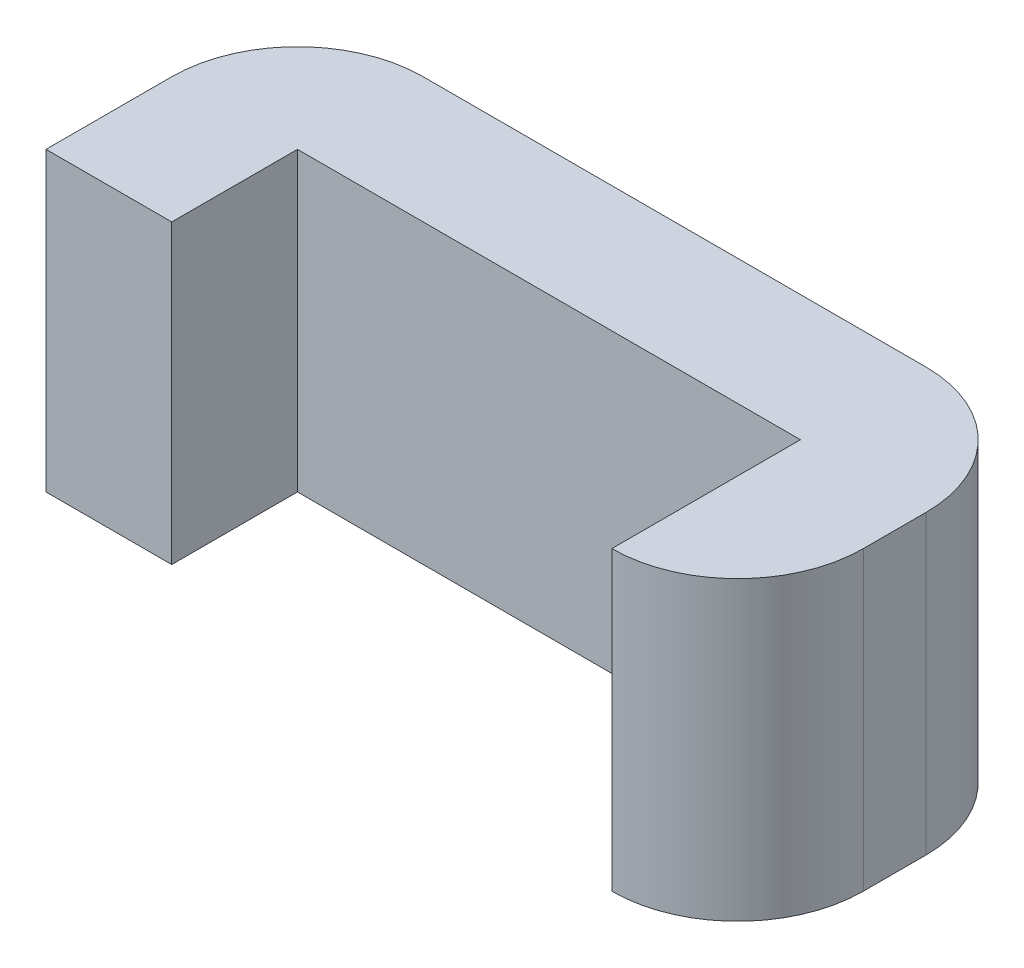
ISO-10303-21;
HEADER;
FILE_DESCRIPTION(('STEP AP214'),'2;1');
FILE_NAME('part.step','',(''),(''),'','','');
FILE_SCHEMA(('AUTOMOTIVE_DESIGN { 1 0 10303 214 1 1 1 1 }'));
ENDSEC;
DATA;
#1=APPLICATION_CONTEXT('core data for automotive mechanical design processes');
#2=APPLICATION_PROTOCOL_DEFINITION('international standard','automotive_design',2000,#1);
#3=PRODUCT_CONTEXT('',#1,'mechanical');
#4=PRODUCT('Part','Part','',(#3));
#5=PRODUCT_RELATED_PRODUCT_CATEGORY('part','',(#4));
#6=PRODUCT_DEFINITION_FORMATION('','',#4);
#7=PRODUCT_DEFINITION_CONTEXT('part definition',#1,'design');
#8=PRODUCT_DEFINITION('design','',#6,#7);
#9=PRODUCT_DEFINITION_SHAPE('','',#8);
#10=(LENGTH_UNIT() NAMED_UNIT(*) SI_UNIT(.MILLI.,.METRE.));
#11=(NAMED_UNIT(*) PLANE_ANGLE_UNIT() SI_UNIT($,.RADIAN.));
#12=(NAMED_UNIT(*) SI_UNIT($,.STERADIAN.) SOLID_ANGLE_UNIT());
#13=UNCERTAINTY_MEASURE_WITH_UNIT(LENGTH_MEASURE(1.E-05),#10,'distance_accuracy_value','');
#14=(GEOMETRIC_REPRESENTATION_CONTEXT(3) GLOBAL_UNCERTAINTY_ASSIGNED_CONTEXT((#13)) GLOBAL_UNIT_ASSIGNED_CONTEXT((#10,
#11,#12)) REPRESENTATION_CONTEXT('',''));
#15=CARTESIAN_POINT('',(0.,0.,0.));
#16=DIRECTION('',(0.,0.,1.));
#17=DIRECTION('',(1.,0.,0.));
#18=AXIS2_PLACEMENT_3D('',#15,#16,#17);
#19=CARTESIAN_POINT('',(0.5,-0.295,0.25));
#20=DIRECTION('',(0.,0.,-1.));
#21=DIRECTION('',(-1.,0.,0.));
#22=AXIS2_PLACEMENT_3D('',#19,#20,#21);
#23=PLANE('',#22);
#24=DIRECTION('',(0.,1.,0.));
#25=VECTOR('',#24,1.);
#26=CARTESIAN_POINT('',(1.5,-0.295,0.25));
#27=LINE('',#26,#25);
#28=CARTESIAN_POINT('',(1.5,-0.295,0.25));
#29=VERTEX_POINT('',#28);
#30=CARTESIAN_POINT('',(1.5,0.295,0.25));
#31=VERTEX_POINT('',#30);
#32=EDGE_CURVE('E124',#29,#31,#27,.T.);
#33=ORIENTED_EDGE('',*,*,#32,.T.);
#34=DIRECTION('',(1.,0.,0.));
#35=VECTOR('',#34,1.);
#36=CARTESIAN_POINT('',(1.5,0.295,0.25));
#37=LINE('',#36,#35);
#38=CARTESIAN_POINT('',(0.5,0.295,0.25));
#39=VERTEX_POINT('',#38);
#40=EDGE_CURVE('E111',#31,#39,#37,.F.);
#41=ORIENTED_EDGE('',*,*,#40,.T.);
#42=DIRECTION('',(0.,1.,0.));
#43=VECTOR('',#42,1.);
#44=CARTESIAN_POINT('',(0.5,-0.295,0.25));
#45=LINE('',#44,#43);
#46=CARTESIAN_POINT('',(0.5,-0.295,0.25));
#47=VERTEX_POINT('',#46);
#48=EDGE_CURVE('E107',#39,#47,#45,.F.);
#49=ORIENTED_EDGE('',*,*,#48,.T.);
#50=DIRECTION('',(1.,0.,0.));
#51=VECTOR('',#50,1.);
#52=CARTESIAN_POINT('',(1.5,-0.295,0.25));
#53=LINE('',#52,#51);
#54=EDGE_CURVE('E125',#29,#47,#53,.F.);
#55=ORIENTED_EDGE('',*,*,#54,.F.);
#56=EDGE_LOOP('',(#33,#41,#49,#55));
#57=FACE_BOUND('',#56,.T.);
#58=ADVANCED_FACE('F16',(#57),#23,.F.);
#59=CARTESIAN_POINT('',(0.5,-0.295,0.5));
#60=DIRECTION('',(-1.,0.,0.));
#61=DIRECTION('',(0.,0.,1.));
#62=AXIS2_PLACEMENT_3D('',#59,#60,#61);
#63=PLANE('',#62);
#64=ORIENTED_EDGE('',*,*,#48,.F.);
#65=DIRECTION('',(0.,0.,-1.));
#66=VECTOR('',#65,1.);
#67=CARTESIAN_POINT('',(0.5,0.295,0.25));
#68=LINE('',#67,#66);
#69=CARTESIAN_POINT('',(0.5,0.295,0.5));
#70=VERTEX_POINT('',#69);
#71=EDGE_CURVE('E119',#39,#70,#68,.F.);
#72=ORIENTED_EDGE('',*,*,#71,.T.);
#73=DIRECTION('',(0.,1.,0.));
#74=VECTOR('',#73,1.);
#75=CARTESIAN_POINT('',(0.5,-0.295,0.5));
#76=LINE('',#75,#74);
#77=CARTESIAN_POINT('',(0.5,-0.295,0.5));
#78=VERTEX_POINT('',#77);
#79=EDGE_CURVE('E176',#70,#78,#76,.F.);
#80=ORIENTED_EDGE('',*,*,#79,.T.);
#81=DIRECTION('',(0.,0.,-1.));
#82=VECTOR('',#81,1.);
#83=CARTESIAN_POINT('',(0.5,-0.295,0.25));
#84=LINE('',#83,#82);
#85=EDGE_CURVE('E167',#47,#78,#84,.F.);
#86=ORIENTED_EDGE('',*,*,#85,.F.);
#87=EDGE_LOOP('',(#64,#72,#80,#86));
#88=FACE_BOUND('',#87,.T.);
#89=ADVANCED_FACE('F226',(#88),#63,.F.);
#90=CARTESIAN_POINT('',(0.25,-0.295,0.5));
#91=DIRECTION('',(0.,0.,-1.));
#92=DIRECTION('',(-1.,0.,0.));
#93=AXIS2_PLACEMENT_3D('',#90,#91,#92);
#94=PLANE('',#93);
#95=ORIENTED_EDGE('',*,*,#79,.F.);
#96=DIRECTION('',(1.,0.,0.));
#97=VECTOR('',#96,1.);
#98=CARTESIAN_POINT('',(1.5,0.295,0.5));
#99=LINE('',#98,#97);
#100=CARTESIAN_POINT('',(0.25,0.295,0.5));
#101=VERTEX_POINT('',#100);
#102=EDGE_CURVE('E144',#70,#101,#99,.F.);
#103=ORIENTED_EDGE('',*,*,#102,.T.);
#104=DIRECTION('',(0.,1.,0.));
#105=VECTOR('',#104,1.);
#106=CARTESIAN_POINT('',(0.25,-0.295,0.5));
#107=LINE('',#106,#105);
#108=CARTESIAN_POINT('',(0.25,-0.295,0.5));
#109=VERTEX_POINT('',#108);
#110=EDGE_CURVE('E183',#101,#109,#107,.F.);
#111=ORIENTED_EDGE('',*,*,#110,.T.);
#112=DIRECTION('',(1.,0.,0.));
#113=VECTOR('',#112,1.);
#114=CARTESIAN_POINT('',(1.5,-0.295,0.5));
#115=LINE('',#114,#113);
#116=EDGE_CURVE('E85',#78,#109,#115,.F.);
#117=ORIENTED_EDGE('',*,*,#116,.F.);
#118=EDGE_LOOP('',(#95,#103,#111,#117));
#119=FACE_BOUND('',#118,.T.);
#120=ADVANCED_FACE('F225',(#119),#94,.F.);
#121=CARTESIAN_POINT('',(0.25,-0.295,0.25));
#122=DIRECTION('',(1.,0.,0.));
#123=DIRECTION('',(0.,0.,-1.));
#124=AXIS2_PLACEMENT_3D('',#121,#122,#123);
#125=PLANE('',#124);
#126=ORIENTED_EDGE('',*,*,#110,.F.);
#127=DIRECTION('',(0.,0.,-1.));
#128=VECTOR('',#127,1.);
#129=CARTESIAN_POINT('',(0.25,0.295,0.25));
#130=LINE('',#129,#128);
#131=CARTESIAN_POINT('',(0.25,0.295,0.25));
#132=VERTEX_POINT('',#131);
#133=EDGE_CURVE('E147',#101,#132,#130,.T.);
#134=ORIENTED_EDGE('',*,*,#133,.T.);
#135=DIRECTION('',(0.,-1.,0.));
#136=VECTOR('',#135,1.);
#137=CARTESIAN_POINT('',(0.25,-0.295,0.25));
#138=LINE('',#137,#136);
#139=CARTESIAN_POINT('',(0.25,-0.295,0.25));
#140=VERTEX_POINT('',#139);
#141=EDGE_CURVE('E133',#140,#132,#138,.F.);
#142=ORIENTED_EDGE('',*,*,#141,.F.);
#143=DIRECTION('',(0.,0.,-1.));
#144=VECTOR('',#143,1.);
#145=CARTESIAN_POINT('',(0.25,-0.295,0.25));
#146=LINE('',#145,#144);
#147=EDGE_CURVE('E79',#109,#140,#146,.T.);
#148=ORIENTED_EDGE('',*,*,#147,.F.);
#149=EDGE_LOOP('',(#126,#134,#142,#148));
#150=FACE_BOUND('',#149,.T.);
#151=ADVANCED_FACE('F223',(#150),#125,.F.);
#152=CARTESIAN_POINT('',(1.75,-0.295,0.375));
#153=DIRECTION('',(-1.,0.,0.));
#154=DIRECTION('',(0.,0.,1.));
#155=AXIS2_PLACEMENT_3D('',#152,#153,#154);
#156=PLANE('',#155);
#157=DIRECTION('',(0.,-1.,0.));
#158=VECTOR('',#157,1.);
#159=CARTESIAN_POINT('',(1.75,-0.295,0.25));
#160=LINE('',#159,#158);
#161=CARTESIAN_POINT('',(1.75,0.295,0.25));
#162=VERTEX_POINT('',#161);
#163=CARTESIAN_POINT('',(1.75,-0.295,0.25));
#164=VERTEX_POINT('',#163);
#165=EDGE_CURVE('E73',#162,#164,#160,.T.);
#166=ORIENTED_EDGE('',*,*,#165,.F.);
#167=DIRECTION('',(0.,0.,-1.));
#168=VECTOR('',#167,1.);
#169=CARTESIAN_POINT('',(1.75,0.295,0.25));
#170=LINE('',#169,#168);
#171=CARTESIAN_POINT('',(1.75,0.295,0.375));
#172=VERTEX_POINT('',#171);
#173=EDGE_CURVE('E138',#162,#172,#170,.F.);
#174=ORIENTED_EDGE('',*,*,#173,.T.);
#175=DIRECTION('',(0.,-1.,0.));
#176=VECTOR('',#175,1.);
#177=CARTESIAN_POINT('',(1.75,-0.295,0.375));
#178=LINE('',#177,#176);
#179=CARTESIAN_POINT('',(1.75,-0.295,0.375));
#180=VERTEX_POINT('',#179);
#181=EDGE_CURVE('E189',#180,#172,#178,.F.);
#182=ORIENTED_EDGE('',*,*,#181,.F.);
#183=DIRECTION('',(0.,0.,-1.));
#184=VECTOR('',#183,1.);
#185=CARTESIAN_POINT('',(1.75,-0.295,0.25));
#186=LINE('',#185,#184);
#187=EDGE_CURVE('E159',#164,#180,#186,.F.);
#188=ORIENTED_EDGE('',*,*,#187,.F.);
#189=EDGE_LOOP('',(#166,#174,#182,#188));
#190=FACE_BOUND('',#189,.T.);
#191=ADVANCED_FACE('F215',(#190),#156,.F.);
#192=CARTESIAN_POINT('',(1.5,-0.295,0.375));
#193=DIRECTION('',(0.,-1.,0.));
#194=DIRECTION('',(0.,0.,-1.));
#195=AXIS2_PLACEMENT_3D('',#192,#193,#194);
#196=CYLINDRICAL_SURFACE('',#195,0.25);
#197=CARTESIAN_POINT('',(1.5,0.295,0.375));
#198=DIRECTION('',(0.,-1.,0.));
#199=DIRECTION('',(0.,0.,-1.));
#200=AXIS2_PLACEMENT_3D('',#197,#198,#199);
#201=CIRCLE('',#200,0.25);
#202=CARTESIAN_POINT('',(1.5,0.295,0.625));
#203=VERTEX_POINT('',#202);
#204=EDGE_CURVE('E134',#172,#203,#201,.T.);
#205=ORIENTED_EDGE('',*,*,#204,.T.);
#206=DIRECTION('',(0.,1.,0.));
#207=VECTOR('',#206,1.);
#208=CARTESIAN_POINT('',(1.5,-0.295,0.625));
#209=LINE('',#208,#207);
#210=CARTESIAN_POINT('',(1.5,-0.295,0.625));
#211=VERTEX_POINT('',#210);
#212=EDGE_CURVE('E128',#203,#211,#209,.F.);
#213=ORIENTED_EDGE('',*,*,#212,.T.);
#214=CARTESIAN_POINT('',(1.5,-0.295,0.375));
#215=DIRECTION('',(0.,-1.,0.));
#216=DIRECTION('',(0.,0.,-1.));
#217=AXIS2_PLACEMENT_3D('',#214,#215,#216);
#218=CIRCLE('',#217,0.25);
#219=EDGE_CURVE('E155',#180,#211,#218,.T.);
#220=ORIENTED_EDGE('',*,*,#219,.F.);
#221=ORIENTED_EDGE('',*,*,#181,.T.);
#222=EDGE_LOOP('',(#205,#213,#220,#221));
#223=FACE_BOUND('',#222,.T.);
#224=ADVANCED_FACE('F217',(#223),#196,.T.);
#225=CARTESIAN_POINT('',(1.5,-0.295,0.25));
#226=DIRECTION('',(1.,0.,0.));
#227=DIRECTION('',(0.,0.,-1.));
#228=AXIS2_PLACEMENT_3D('',#225,#226,#227);
#229=PLANE('',#228);
#230=DIRECTION('',(0.,0.,-1.));
#231=VECTOR('',#230,1.);
#232=CARTESIAN_POINT('',(1.5,-0.295,0.25));
#233=LINE('',#232,#231);
#234=EDGE_CURVE('E158',#211,#29,#233,.T.);
#235=ORIENTED_EDGE('',*,*,#234,.F.);
#236=ORIENTED_EDGE('',*,*,#212,.F.);
#237=DIRECTION('',(0.,0.,-1.));
#238=VECTOR('',#237,1.);
#239=CARTESIAN_POINT('',(1.5,0.295,0.25));
#240=LINE('',#239,#238);
#241=EDGE_CURVE('E116',#203,#31,#240,.T.);
#242=ORIENTED_EDGE('',*,*,#241,.T.);
#243=ORIENTED_EDGE('',*,*,#32,.F.);
#244=EDGE_LOOP('',(#235,#236,#242,#243));
#245=FACE_BOUND('',#244,.T.);
#246=ADVANCED_FACE('F130',(#245),#229,.F.);
#247=CARTESIAN_POINT('',(1.5,-0.295,0.25));
#248=DIRECTION('',(0.,-1.,0.));
#249=DIRECTION('',(0.,0.,-1.));
#250=AXIS2_PLACEMENT_3D('',#247,#248,#249);
#251=CYLINDRICAL_SURFACE('',#250,0.25);
#252=CARTESIAN_POINT('',(1.5,0.295,0.25));
#253=DIRECTION('',(0.,-1.,0.));
#254=DIRECTION('',(0.,0.,-1.));
#255=AXIS2_PLACEMENT_3D('',#252,#253,#254);
#256=CIRCLE('',#255,0.25);
#257=CARTESIAN_POINT('',(1.5,0.295,0.));
#258=VERTEX_POINT('',#257);
#259=EDGE_CURVE('E19',#258,#162,#256,.T.);
#260=ORIENTED_EDGE('',*,*,#259,.T.);
#261=ORIENTED_EDGE('',*,*,#165,.T.);
#262=CARTESIAN_POINT('',(1.5,-0.295,0.25));
#263=DIRECTION('',(0.,-1.,0.));
#264=DIRECTION('',(0.,0.,-1.));
#265=AXIS2_PLACEMENT_3D('',#262,#263,#264);
#266=CIRCLE('',#265,0.25);
#267=CARTESIAN_POINT('',(1.5,-0.295,0.));
#268=VERTEX_POINT('',#267);
#269=EDGE_CURVE('E160',#268,#164,#266,.T.);
#270=ORIENTED_EDGE('',*,*,#269,.F.);
#271=DIRECTION('',(0.,1.,0.));
#272=VECTOR('',#271,1.);
#273=CARTESIAN_POINT('',(1.5,-0.295,0.));
#274=LINE('',#273,#272);
#275=EDGE_CURVE('E63',#268,#258,#274,.T.);
#276=ORIENTED_EDGE('',*,*,#275,.T.);
#277=EDGE_LOOP('',(#260,#261,#270,#276));
#278=FACE_BOUND('',#277,.T.);
#279=ADVANCED_FACE('F218',(#278),#251,.T.);
#280=CARTESIAN_POINT('',(1.5,0.295,0.25));
#281=DIRECTION('',(0.,-1.,0.));
#282=DIRECTION('',(0.,0.,-1.));
#283=AXIS2_PLACEMENT_3D('',#280,#281,#282);
#284=PLANE('',#283);
#285=ORIENTED_EDGE('',*,*,#241,.F.);
#286=ORIENTED_EDGE('',*,*,#204,.F.);
#287=ORIENTED_EDGE('',*,*,#173,.F.);
#288=ORIENTED_EDGE('',*,*,#259,.F.);
#289=DIRECTION('',(1.,0.,0.));
#290=VECTOR('',#289,1.);
#291=CARTESIAN_POINT('',(1.5,0.295,0.));
#292=LINE('',#291,#290);
#293=CARTESIAN_POINT('',(0.5,0.295,0.));
#294=VERTEX_POINT('',#293);
#295=EDGE_CURVE('E203',#258,#294,#292,.F.);
#296=ORIENTED_EDGE('',*,*,#295,.T.);
#297=CARTESIAN_POINT('',(0.5,0.295,0.25));
#298=DIRECTION('',(0.,-1.,0.));
#299=DIRECTION('',(0.,0.,-1.));
#300=AXIS2_PLACEMENT_3D('',#297,#298,#299);
#301=CIRCLE('',#300,0.25);
#302=EDGE_CURVE('E136',#132,#294,#301,.T.);
#303=ORIENTED_EDGE('',*,*,#302,.F.);
#304=ORIENTED_EDGE('',*,*,#133,.F.);
#305=ORIENTED_EDGE('',*,*,#102,.F.);
#306=ORIENTED_EDGE('',*,*,#71,.F.);
#307=ORIENTED_EDGE('',*,*,#40,.F.);
#308=EDGE_LOOP('',(#285,#286,#287,#288,#296,#303,#304,#305,#306,#307));
#309=FACE_BOUND('',#308,.T.);
#310=ADVANCED_FACE('F113',(#309),#284,.F.);
#311=CARTESIAN_POINT('',(0.5,-0.295,0.25));
#312=DIRECTION('',(0.,-1.,0.));
#313=DIRECTION('',(0.,0.,-1.));
#314=AXIS2_PLACEMENT_3D('',#311,#312,#313);
#315=CYLINDRICAL_SURFACE('',#314,0.25);
#316=ORIENTED_EDGE('',*,*,#302,.T.);
#317=DIRECTION('',(0.,1.,0.));
#318=VECTOR('',#317,1.);
#319=CARTESIAN_POINT('',(0.5,-0.295,0.));
#320=LINE('',#319,#318);
#321=CARTESIAN_POINT('',(0.5,-0.295,0.));
#322=VERTEX_POINT('',#321);
#323=EDGE_CURVE('E25',#294,#322,#320,.F.);
#324=ORIENTED_EDGE('',*,*,#323,.T.);
#325=CARTESIAN_POINT('',(0.5,-0.295,0.25));
#326=DIRECTION('',(0.,-1.,0.));
#327=DIRECTION('',(0.,0.,-1.));
#328=AXIS2_PLACEMENT_3D('',#325,#326,#327);
#329=CIRCLE('',#328,0.25);
#330=EDGE_CURVE('E33',#140,#322,#329,.T.);
#331=ORIENTED_EDGE('',*,*,#330,.F.);
#332=ORIENTED_EDGE('',*,*,#141,.T.);
#333=EDGE_LOOP('',(#316,#324,#331,#332));
#334=FACE_BOUND('',#333,.T.);
#335=ADVANCED_FACE('F220',(#334),#315,.T.);
#336=CARTESIAN_POINT('',(1.5,-0.295,0.25));
#337=DIRECTION('',(0.,-1.,0.));
#338=DIRECTION('',(0.,0.,-1.));
#339=AXIS2_PLACEMENT_3D('',#336,#337,#338);
#340=PLANE('',#339);
#341=ORIENTED_EDGE('',*,*,#219,.T.);
#342=ORIENTED_EDGE('',*,*,#234,.T.);
#343=ORIENTED_EDGE('',*,*,#54,.T.);
#344=ORIENTED_EDGE('',*,*,#85,.T.);
#345=ORIENTED_EDGE('',*,*,#116,.T.);
#346=ORIENTED_EDGE('',*,*,#147,.T.);
#347=ORIENTED_EDGE('',*,*,#330,.T.);
#348=DIRECTION('',(1.,0.,0.));
#349=VECTOR('',#348,1.);
#350=CARTESIAN_POINT('',(1.5,-0.295,0.));
#351=LINE('',#350,#349);
#352=EDGE_CURVE('E11',#322,#268,#351,.T.);
#353=ORIENTED_EDGE('',*,*,#352,.T.);
#354=ORIENTED_EDGE('',*,*,#269,.T.);
#355=ORIENTED_EDGE('',*,*,#187,.T.);
#356=EDGE_LOOP('',(#341,#342,#343,#344,#345,#346,#347,#353,#354,#355));
#357=FACE_BOUND('',#356,.T.);
#358=ADVANCED_FACE('F212',(#357),#340,.T.);
#359=CARTESIAN_POINT('',(1.5,-0.295,0.));
#360=DIRECTION('',(0.,0.,1.));
#361=DIRECTION('',(1.,0.,0.));
#362=AXIS2_PLACEMENT_3D('',#359,#360,#361);
#363=PLANE('',#362);
#364=ORIENTED_EDGE('',*,*,#323,.F.);
#365=ORIENTED_EDGE('',*,*,#295,.F.);
#366=ORIENTED_EDGE('',*,*,#275,.F.);
#367=ORIENTED_EDGE('',*,*,#352,.F.);
#368=EDGE_LOOP('',(#364,#365,#366,#367));
#369=FACE_BOUND('',#368,.T.);
#370=ADVANCED_FACE('F219',(#369),#363,.F.);
#371=CLOSED_SHELL('',(#58,#89,#120,#151,#191,#224,#246,#279,#310,#335,#358,#370));
#372=MANIFOLD_SOLID_BREP('B1',#371);
#373=ADVANCED_BREP_SHAPE_REPRESENTATION('',(#18,#372),#14);
#374=SHAPE_DEFINITION_REPRESENTATION(#9,#373);
ENDSEC;
END-ISO-10303-21;
